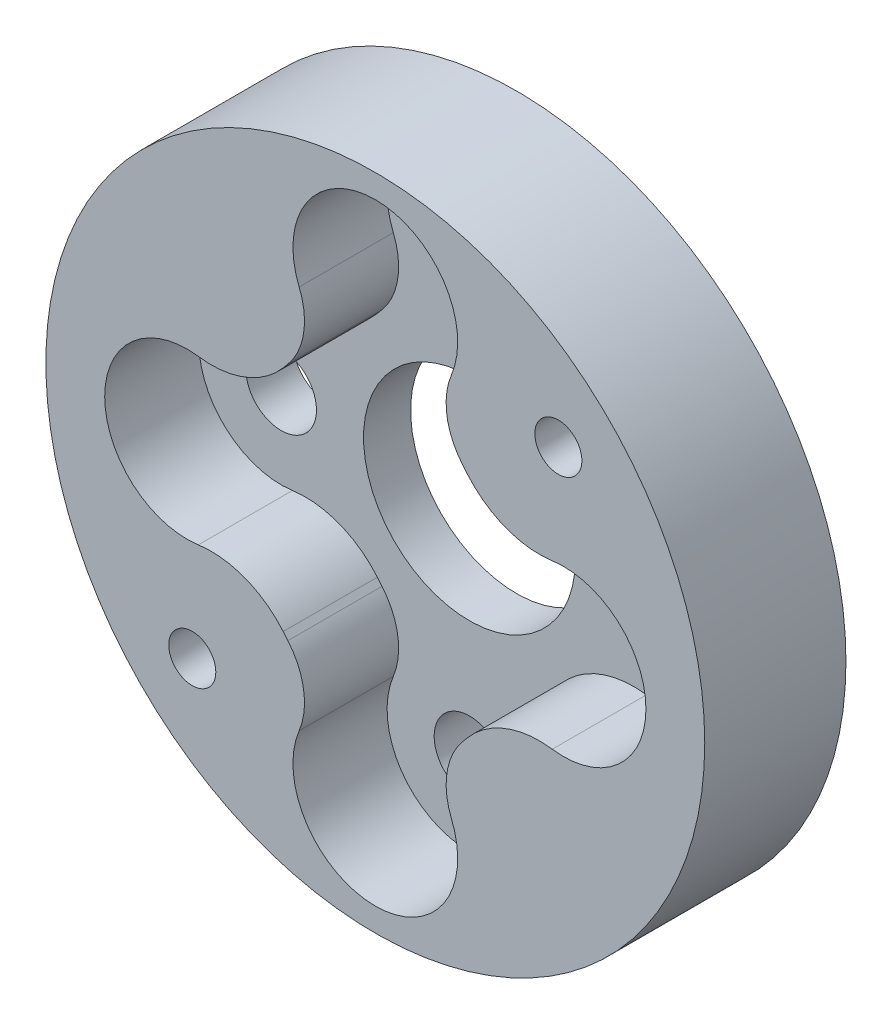
ISO-10303-21;
HEADER;
FILE_DESCRIPTION(('STEP AP214'),'2;1');
FILE_NAME('part.step','',(''),(''),'','','');
FILE_SCHEMA(('AUTOMOTIVE_DESIGN { 1 0 10303 214 1 1 1 1 }'));
ENDSEC;
DATA;
#1=APPLICATION_CONTEXT('core data for automotive mechanical design processes');
#2=APPLICATION_PROTOCOL_DEFINITION('international standard','automotive_design',2000,#1);
#3=PRODUCT_CONTEXT('',#1,'mechanical');
#4=PRODUCT('Part','Part','',(#3));
#5=PRODUCT_RELATED_PRODUCT_CATEGORY('part','',(#4));
#6=PRODUCT_DEFINITION_FORMATION('','',#4);
#7=PRODUCT_DEFINITION_CONTEXT('part definition',#1,'design');
#8=PRODUCT_DEFINITION('design','',#6,#7);
#9=PRODUCT_DEFINITION_SHAPE('','',#8);
#10=(LENGTH_UNIT() NAMED_UNIT(*) SI_UNIT(.MILLI.,.METRE.));
#11=(NAMED_UNIT(*) PLANE_ANGLE_UNIT() SI_UNIT($,.RADIAN.));
#12=(NAMED_UNIT(*) SI_UNIT($,.STERADIAN.) SOLID_ANGLE_UNIT());
#13=UNCERTAINTY_MEASURE_WITH_UNIT(LENGTH_MEASURE(1.E-05),#10,'distance_accuracy_value','');
#14=(GEOMETRIC_REPRESENTATION_CONTEXT(3) GLOBAL_UNCERTAINTY_ASSIGNED_CONTEXT((#13)) GLOBAL_UNIT_ASSIGNED_CONTEXT((#10,
#11,#12)) REPRESENTATION_CONTEXT('',''));
#15=CARTESIAN_POINT('',(0.,0.,0.));
#16=DIRECTION('',(0.,0.,1.));
#17=DIRECTION('',(1.,0.,0.));
#18=AXIS2_PLACEMENT_3D('',#15,#16,#17);
#19=CARTESIAN_POINT('',(0.,0.,2.));
#20=DIRECTION('',(0.,0.,-1.));
#21=DIRECTION('',(-1.,0.,0.));
#22=AXIS2_PLACEMENT_3D('',#19,#20,#21);
#23=CYLINDRICAL_SURFACE('',#22,14.);
#24=CARTESIAN_POINT('',(0.,0.,0.));
#25=DIRECTION('',(0.,0.,1.));
#26=DIRECTION('',(1.,0.,0.));
#27=AXIS2_PLACEMENT_3D('',#24,#25,#26);
#28=CIRCLE('',#27,14.);
#29=CARTESIAN_POINT('',(14.,0.,0.));
#30=VERTEX_POINT('',#29);
#31=EDGE_CURVE('E11',#30,#30,#28,.T.);
#32=ORIENTED_EDGE('',*,*,#31,.T.);
#33=EDGE_LOOP('',(#32));
#34=FACE_BOUND('',#33,.T.);
#35=CARTESIAN_POINT('',(0.,0.,6.));
#36=DIRECTION('',(0.,0.,1.));
#37=DIRECTION('',(1.,0.,0.));
#38=AXIS2_PLACEMENT_3D('',#35,#36,#37);
#39=CIRCLE('',#38,14.);
#40=CARTESIAN_POINT('',(14.,0.,6.));
#41=VERTEX_POINT('',#40);
#42=EDGE_CURVE('E273',#41,#41,#39,.T.);
#43=ORIENTED_EDGE('',*,*,#42,.F.);
#44=EDGE_LOOP('',(#43));
#45=FACE_BOUND('',#44,.T.);
#46=ADVANCED_FACE('F32',(#34,#45),#23,.T.);
#47=CARTESIAN_POINT('',(0.,0.,2.));
#48=DIRECTION('',(0.,0.,1.));
#49=DIRECTION('',(1.,0.,0.));
#50=AXIS2_PLACEMENT_3D('',#47,#48,#49);
#51=PLANE('',#50);
#52=CARTESIAN_POINT('',(-6.97306161399816,7.42936050756429,2.));
#53=DIRECTION('',(0.,0.,-1.));
#54=DIRECTION('',(-1.,0.,0.));
#55=AXIS2_PLACEMENT_3D('',#52,#53,#54);
#56=CIRCLE('',#55,4.);
#57=CARTESIAN_POINT('',(-3.91341682152996,4.85281752443317,2.));
#58=VERTEX_POINT('',#57);
#59=CARTESIAN_POINT('',(-7.52076208653247,3.46703490353,2.));
#60=VERTEX_POINT('',#59);
#61=EDGE_CURVE('E152',#58,#60,#56,.T.);
#62=ORIENTED_EDGE('',*,*,#61,.T.);
#63=CARTESIAN_POINT('',(-8.,0.,2.));
#64=DIRECTION('',(0.,0.,1.));
#65=DIRECTION('',(1.,0.,0.));
#66=AXIS2_PLACEMENT_3D('',#63,#64,#65);
#67=CIRCLE('',#66,3.5);
#68=CARTESIAN_POINT('',(-7.52076208653248,-3.46703490353,2.));
#69=VERTEX_POINT('',#68);
#70=EDGE_CURVE('E196',#60,#69,#67,.T.);
#71=ORIENTED_EDGE('',*,*,#70,.T.);
#72=CARTESIAN_POINT('',(-6.97306161399816,-7.42936050756429,2.));
#73=DIRECTION('',(0.,0.,-1.));
#74=DIRECTION('',(-1.,0.,0.));
#75=AXIS2_PLACEMENT_3D('',#72,#73,#74);
#76=CIRCLE('',#75,4.);
#77=CARTESIAN_POINT('',(-3.91341682152996,-4.85281752443317,2.));
#78=VERTEX_POINT('',#77);
#79=EDGE_CURVE('E158',#69,#78,#76,.T.);
#80=ORIENTED_EDGE('',*,*,#79,.T.);
#81=DIRECTION('',(0.644135745782779,-0.764911198117051,0.));
#82=VECTOR('',#81,1.);
#83=CARTESIAN_POINT('',(-3.91341682152996,-4.85281752443317,2.));
#84=LINE('',#83,#82);
#85=CARTESIAN_POINT('',(-3.71426790385243,-5.08930686417524,2.));
#86=VERTEX_POINT('',#85);
#87=EDGE_CURVE('E200',#78,#86,#84,.T.);
#88=ORIENTED_EDGE('',*,*,#87,.T.);
#89=CARTESIAN_POINT('',(-6.00900149820358,-7.02171410152358,2.));
#90=DIRECTION('',(0.,0.,-1.));
#91=DIRECTION('',(-1.,0.,0.));
#92=AXIS2_PLACEMENT_3D('',#89,#90,#91);
#93=CIRCLE('',#92,3.);
#94=CARTESIAN_POINT('',(-3.23561619134039,-8.16553836235885,2.));
#95=VERTEX_POINT('',#94);
#96=EDGE_CURVE('E203',#86,#95,#93,.T.);
#97=ORIENTED_EDGE('',*,*,#96,.T.);
#98=CARTESIAN_POINT('',(0.,-9.5,2.));
#99=DIRECTION('',(0.,0.,1.));
#100=DIRECTION('',(1.,0.,0.));
#101=AXIS2_PLACEMENT_3D('',#98,#99,#100);
#102=CIRCLE('',#101,3.5);
#103=CARTESIAN_POINT('',(3.23561619134039,-8.16553836235885,2.));
#104=VERTEX_POINT('',#103);
#105=EDGE_CURVE('E206',#95,#104,#102,.T.);
#106=ORIENTED_EDGE('',*,*,#105,.T.);
#107=CARTESIAN_POINT('',(6.00900149820358,-7.02171410152358,2.));
#108=DIRECTION('',(0.,0.,-1.));
#109=DIRECTION('',(-1.,0.,0.));
#110=AXIS2_PLACEMENT_3D('',#107,#108,#109);
#111=CIRCLE('',#110,3.);
#112=CARTESIAN_POINT('',(3.71426790385243,-5.08930686417524,2.));
#113=VERTEX_POINT('',#112);
#114=EDGE_CURVE('E209',#104,#113,#111,.T.);
#115=ORIENTED_EDGE('',*,*,#114,.T.);
#116=DIRECTION('',(0.644135745782779,0.764911198117051,0.));
#117=VECTOR('',#116,1.);
#118=CARTESIAN_POINT('',(3.71426790385243,-5.08930686417524,2.));
#119=LINE('',#118,#117);
#120=CARTESIAN_POINT('',(3.91341682152996,-4.85281752443317,2.));
#121=VERTEX_POINT('',#120);
#122=EDGE_CURVE('E212',#113,#121,#119,.T.);
#123=ORIENTED_EDGE('',*,*,#122,.T.);
#124=CARTESIAN_POINT('',(6.97306161399816,-7.42936050756429,2.));
#125=DIRECTION('',(0.,0.,-1.));
#126=DIRECTION('',(-1.,0.,0.));
#127=AXIS2_PLACEMENT_3D('',#124,#125,#126);
#128=CIRCLE('',#127,4.);
#129=CARTESIAN_POINT('',(7.52076208653248,-3.46703490353,2.));
#130=VERTEX_POINT('',#129);
#131=EDGE_CURVE('E215',#121,#130,#128,.T.);
#132=ORIENTED_EDGE('',*,*,#131,.T.);
#133=CARTESIAN_POINT('',(8.,0.,2.));
#134=DIRECTION('',(0.,0.,1.));
#135=DIRECTION('',(-1.,0.,0.));
#136=AXIS2_PLACEMENT_3D('',#133,#134,#135);
#137=CIRCLE('',#136,3.5);
#138=CARTESIAN_POINT('',(7.52076208653248,3.46703490353,2.));
#139=VERTEX_POINT('',#138);
#140=EDGE_CURVE('E218',#130,#139,#137,.T.);
#141=ORIENTED_EDGE('',*,*,#140,.T.);
#142=CARTESIAN_POINT('',(6.97306161399816,7.42936050756429,2.));
#143=DIRECTION('',(0.,0.,-1.));
#144=DIRECTION('',(1.,0.,0.));
#145=AXIS2_PLACEMENT_3D('',#142,#143,#144);
#146=CIRCLE('',#145,4.);
#147=CARTESIAN_POINT('',(3.91341682152996,4.85281752443317,2.));
#148=VERTEX_POINT('',#147);
#149=EDGE_CURVE('E221',#139,#148,#146,.T.);
#150=ORIENTED_EDGE('',*,*,#149,.T.);
#151=DIRECTION('',(-0.644135745782779,0.764911198117051,0.));
#152=VECTOR('',#151,1.);
#153=CARTESIAN_POINT('',(3.91341682152996,4.85281752443317,2.));
#154=LINE('',#153,#152);
#155=CARTESIAN_POINT('',(3.71426790385243,5.08930686417524,2.));
#156=VERTEX_POINT('',#155);
#157=EDGE_CURVE('E224',#148,#156,#154,.T.);
#158=ORIENTED_EDGE('',*,*,#157,.T.);
#159=CARTESIAN_POINT('',(6.00900149820358,7.02171410152358,2.));
#160=DIRECTION('',(0.,0.,-1.));
#161=DIRECTION('',(-1.,0.,0.));
#162=AXIS2_PLACEMENT_3D('',#159,#160,#161);
#163=CIRCLE('',#162,3.);
#164=CARTESIAN_POINT('',(3.23561619134039,8.16553836235885,2.));
#165=VERTEX_POINT('',#164);
#166=EDGE_CURVE('E227',#156,#165,#163,.T.);
#167=ORIENTED_EDGE('',*,*,#166,.T.);
#168=CARTESIAN_POINT('',(0.,9.5,2.));
#169=DIRECTION('',(0.,0.,1.));
#170=DIRECTION('',(-1.,0.,0.));
#171=AXIS2_PLACEMENT_3D('',#168,#169,#170);
#172=CIRCLE('',#171,3.5);
#173=CARTESIAN_POINT('',(-3.23561619134039,8.16553836235885,2.));
#174=VERTEX_POINT('',#173);
#175=EDGE_CURVE('E230',#165,#174,#172,.T.);
#176=ORIENTED_EDGE('',*,*,#175,.T.);
#177=CARTESIAN_POINT('',(-6.00900149820358,7.02171410152358,2.));
#178=DIRECTION('',(0.,0.,-1.));
#179=DIRECTION('',(-1.,0.,0.));
#180=AXIS2_PLACEMENT_3D('',#177,#178,#179);
#181=CIRCLE('',#180,3.);
#182=CARTESIAN_POINT('',(-3.71426790385243,5.08930686417524,2.));
#183=VERTEX_POINT('',#182);
#184=EDGE_CURVE('E233',#174,#183,#181,.T.);
#185=ORIENTED_EDGE('',*,*,#184,.T.);
#186=DIRECTION('',(-0.644135745782779,-0.764911198117051,0.));
#187=VECTOR('',#186,1.);
#188=CARTESIAN_POINT('',(-3.71426790385243,5.08930686417524,2.));
#189=LINE('',#188,#187);
#190=EDGE_CURVE('E236',#183,#58,#189,.T.);
#191=ORIENTED_EDGE('',*,*,#190,.T.);
#192=EDGE_LOOP('',(#62,#71,#80,#88,#97,#106,#115,#123,#132,#141,#150,#158,#167,#176,#185,#191));
#193=FACE_BOUND('',#192,.T.);
#194=CARTESIAN_POINT('',(-8.,0.,2.));
#195=DIRECTION('',(0.,0.,1.));
#196=DIRECTION('',(1.,0.,0.));
#197=AXIS2_PLACEMENT_3D('',#194,#195,#196);
#198=CIRCLE('',#197,1.5);
#199=CARTESIAN_POINT('',(-6.5,0.,2.));
#200=VERTEX_POINT('',#199);
#201=EDGE_CURVE('E279',#200,#200,#198,.T.);
#202=ORIENTED_EDGE('',*,*,#201,.F.);
#203=EDGE_LOOP('',(#202));
#204=FACE_BOUND('',#203,.T.);
#205=CARTESIAN_POINT('',(0.,0.,2.));
#206=DIRECTION('',(0.,0.,1.));
#207=DIRECTION('',(1.,0.,0.));
#208=AXIS2_PLACEMENT_3D('',#205,#206,#207);
#209=CIRCLE('',#208,4.5);
#210=CARTESIAN_POINT('',(4.5,0.,2.));
#211=VERTEX_POINT('',#210);
#212=EDGE_CURVE('E276',#211,#211,#209,.T.);
#213=ORIENTED_EDGE('',*,*,#212,.F.);
#214=EDGE_LOOP('',(#213));
#215=FACE_BOUND('',#214,.T.);
#216=CARTESIAN_POINT('',(0.,-9.5,2.));
#217=DIRECTION('',(0.,0.,1.));
#218=DIRECTION('',(-1.,0.,0.));
#219=AXIS2_PLACEMENT_3D('',#216,#217,#218);
#220=CIRCLE('',#219,1.5);
#221=CARTESIAN_POINT('',(-1.5,-9.5,2.));
#222=VERTEX_POINT('',#221);
#223=EDGE_CURVE('E287',#222,#222,#220,.T.);
#224=ORIENTED_EDGE('',*,*,#223,.F.);
#225=EDGE_LOOP('',(#224));
#226=FACE_BOUND('',#225,.T.);
#227=CARTESIAN_POINT('',(8.,0.,2.));
#228=DIRECTION('',(0.,0.,1.));
#229=DIRECTION('',(-1.,0.,0.));
#230=AXIS2_PLACEMENT_3D('',#227,#228,#229);
#231=CIRCLE('',#230,1.5);
#232=CARTESIAN_POINT('',(6.5,0.,2.));
#233=VERTEX_POINT('',#232);
#234=EDGE_CURVE('E286',#233,#233,#231,.T.);
#235=ORIENTED_EDGE('',*,*,#234,.F.);
#236=EDGE_LOOP('',(#235));
#237=FACE_BOUND('',#236,.T.);
#238=CARTESIAN_POINT('',(0.,9.5,2.));
#239=DIRECTION('',(0.,0.,1.));
#240=DIRECTION('',(1.,0.,0.));
#241=AXIS2_PLACEMENT_3D('',#238,#239,#240);
#242=CIRCLE('',#241,1.5);
#243=CARTESIAN_POINT('',(1.5,9.5,2.));
#244=VERTEX_POINT('',#243);
#245=EDGE_CURVE('E297',#244,#244,#242,.T.);
#246=ORIENTED_EDGE('',*,*,#245,.F.);
#247=EDGE_LOOP('',(#246));
#248=FACE_BOUND('',#247,.T.);
#249=ADVANCED_FACE('F307',(#193,#204,#215,#226,#237,#248),#51,.T.);
#250=CARTESIAN_POINT('',(0.,0.,0.));
#251=DIRECTION('',(0.,0.,1.));
#252=DIRECTION('',(1.,0.,0.));
#253=AXIS2_PLACEMENT_3D('',#250,#251,#252);
#254=PLANE('',#253);
#255=CARTESIAN_POINT('',(7.77817459305201,7.77817459305205,0.));
#256=DIRECTION('',(0.,0.,1.));
#257=DIRECTION('',(1.,0.,0.));
#258=AXIS2_PLACEMENT_3D('',#255,#256,#257);
#259=CIRCLE('',#258,1.00000000000001);
#260=CARTESIAN_POINT('',(8.77817459305201,7.77817459305205,0.));
#261=VERTEX_POINT('',#260);
#262=EDGE_CURVE('E198',#261,#261,#259,.T.);
#263=ORIENTED_EDGE('',*,*,#262,.T.);
#264=EDGE_LOOP('',(#263));
#265=FACE_BOUND('',#264,.T.);
#266=CARTESIAN_POINT('',(-7.77817459305201,-7.77817459305204,0.));
#267=DIRECTION('',(0.,0.,1.));
#268=DIRECTION('',(1.,0.,0.));
#269=AXIS2_PLACEMENT_3D('',#266,#267,#268);
#270=CIRCLE('',#269,1.);
#271=CARTESIAN_POINT('',(-6.77817459305201,-7.77817459305204,0.));
#272=VERTEX_POINT('',#271);
#273=EDGE_CURVE('E352',#272,#272,#270,.T.);
#274=ORIENTED_EDGE('',*,*,#273,.T.);
#275=EDGE_LOOP('',(#274));
#276=FACE_BOUND('',#275,.T.);
#277=CARTESIAN_POINT('',(-8.,0.,0.));
#278=DIRECTION('',(0.,0.,1.));
#279=DIRECTION('',(1.,0.,0.));
#280=AXIS2_PLACEMENT_3D('',#277,#278,#279);
#281=CIRCLE('',#280,1.5);
#282=CARTESIAN_POINT('',(-6.5,0.,0.));
#283=VERTEX_POINT('',#282);
#284=EDGE_CURVE('E39',#283,#283,#281,.T.);
#285=ORIENTED_EDGE('',*,*,#284,.T.);
#286=EDGE_LOOP('',(#285));
#287=FACE_BOUND('',#286,.T.);
#288=CARTESIAN_POINT('',(0.,0.,0.));
#289=DIRECTION('',(0.,0.,1.));
#290=DIRECTION('',(1.,0.,0.));
#291=AXIS2_PLACEMENT_3D('',#288,#289,#290);
#292=CIRCLE('',#291,4.5);
#293=CARTESIAN_POINT('',(4.5,0.,0.));
#294=VERTEX_POINT('',#293);
#295=EDGE_CURVE('E290',#294,#294,#292,.T.);
#296=ORIENTED_EDGE('',*,*,#295,.T.);
#297=EDGE_LOOP('',(#296));
#298=FACE_BOUND('',#297,.T.);
#299=CARTESIAN_POINT('',(0.,-9.5,0.));
#300=DIRECTION('',(0.,0.,1.));
#301=DIRECTION('',(-1.,0.,0.));
#302=AXIS2_PLACEMENT_3D('',#299,#300,#301);
#303=CIRCLE('',#302,1.5);
#304=CARTESIAN_POINT('',(-1.5,-9.5,0.));
#305=VERTEX_POINT('',#304);
#306=EDGE_CURVE('E283',#305,#305,#303,.T.);
#307=ORIENTED_EDGE('',*,*,#306,.T.);
#308=EDGE_LOOP('',(#307));
#309=FACE_BOUND('',#308,.T.);
#310=CARTESIAN_POINT('',(8.,0.,0.));
#311=DIRECTION('',(0.,0.,1.));
#312=DIRECTION('',(-1.,0.,0.));
#313=AXIS2_PLACEMENT_3D('',#310,#311,#312);
#314=CIRCLE('',#313,1.5);
#315=CARTESIAN_POINT('',(6.5,0.,0.));
#316=VERTEX_POINT('',#315);
#317=EDGE_CURVE('E300',#316,#316,#314,.T.);
#318=ORIENTED_EDGE('',*,*,#317,.T.);
#319=EDGE_LOOP('',(#318));
#320=FACE_BOUND('',#319,.T.);
#321=CARTESIAN_POINT('',(0.,9.5,0.));
#322=DIRECTION('',(0.,0.,1.));
#323=DIRECTION('',(1.,0.,0.));
#324=AXIS2_PLACEMENT_3D('',#321,#322,#323);
#325=CIRCLE('',#324,1.5);
#326=CARTESIAN_POINT('',(1.5,9.5,0.));
#327=VERTEX_POINT('',#326);
#328=EDGE_CURVE('E282',#327,#327,#325,.T.);
#329=ORIENTED_EDGE('',*,*,#328,.T.);
#330=EDGE_LOOP('',(#329));
#331=FACE_BOUND('',#330,.T.);
#332=ORIENTED_EDGE('',*,*,#31,.F.);
#333=EDGE_LOOP('',(#332));
#334=FACE_BOUND('',#333,.T.);
#335=ADVANCED_FACE('F310',(#265,#276,#287,#298,#309,#320,#331,#334),#254,.F.);
#336=CARTESIAN_POINT('',(0.,9.5,0.));
#337=DIRECTION('',(0.,0.,1.));
#338=DIRECTION('',(1.,0.,0.));
#339=AXIS2_PLACEMENT_3D('',#336,#337,#338);
#340=CYLINDRICAL_SURFACE('',#339,1.5);
#341=ORIENTED_EDGE('',*,*,#328,.F.);
#342=EDGE_LOOP('',(#341));
#343=FACE_BOUND('',#342,.T.);
#344=ORIENTED_EDGE('',*,*,#245,.T.);
#345=EDGE_LOOP('',(#344));
#346=FACE_BOUND('',#345,.T.);
#347=ADVANCED_FACE('F315',(#343,#346),#340,.F.);
#348=CARTESIAN_POINT('',(8.,0.,0.));
#349=DIRECTION('',(0.,0.,1.));
#350=DIRECTION('',(1.,0.,0.));
#351=AXIS2_PLACEMENT_3D('',#348,#349,#350);
#352=CYLINDRICAL_SURFACE('',#351,1.5);
#353=ORIENTED_EDGE('',*,*,#317,.F.);
#354=EDGE_LOOP('',(#353));
#355=FACE_BOUND('',#354,.T.);
#356=ORIENTED_EDGE('',*,*,#234,.T.);
#357=EDGE_LOOP('',(#356));
#358=FACE_BOUND('',#357,.T.);
#359=ADVANCED_FACE('F305',(#355,#358),#352,.F.);
#360=CARTESIAN_POINT('',(0.,-9.5,0.));
#361=DIRECTION('',(0.,0.,1.));
#362=DIRECTION('',(1.,0.,0.));
#363=AXIS2_PLACEMENT_3D('',#360,#361,#362);
#364=CYLINDRICAL_SURFACE('',#363,1.5);
#365=ORIENTED_EDGE('',*,*,#306,.F.);
#366=EDGE_LOOP('',(#365));
#367=FACE_BOUND('',#366,.T.);
#368=ORIENTED_EDGE('',*,*,#223,.T.);
#369=EDGE_LOOP('',(#368));
#370=FACE_BOUND('',#369,.T.);
#371=ADVANCED_FACE('F323',(#367,#370),#364,.F.);
#372=CARTESIAN_POINT('',(0.,0.,0.));
#373=DIRECTION('',(0.,0.,1.));
#374=DIRECTION('',(1.,0.,0.));
#375=AXIS2_PLACEMENT_3D('',#372,#373,#374);
#376=CYLINDRICAL_SURFACE('',#375,4.5);
#377=ORIENTED_EDGE('',*,*,#295,.F.);
#378=EDGE_LOOP('',(#377));
#379=FACE_BOUND('',#378,.T.);
#380=ORIENTED_EDGE('',*,*,#212,.T.);
#381=EDGE_LOOP('',(#380));
#382=FACE_BOUND('',#381,.T.);
#383=ADVANCED_FACE('F368',(#379,#382),#376,.F.);
#384=CARTESIAN_POINT('',(-8.,0.,0.));
#385=DIRECTION('',(0.,0.,1.));
#386=DIRECTION('',(1.,0.,0.));
#387=AXIS2_PLACEMENT_3D('',#384,#385,#386);
#388=CYLINDRICAL_SURFACE('',#387,1.5);
#389=ORIENTED_EDGE('',*,*,#284,.F.);
#390=EDGE_LOOP('',(#389));
#391=FACE_BOUND('',#390,.T.);
#392=ORIENTED_EDGE('',*,*,#201,.T.);
#393=EDGE_LOOP('',(#392));
#394=FACE_BOUND('',#393,.T.);
#395=ADVANCED_FACE('F341',(#391,#394),#388,.F.);
#396=CARTESIAN_POINT('',(0.,0.,6.));
#397=DIRECTION('',(0.,0.,1.));
#398=DIRECTION('',(1.,0.,0.));
#399=AXIS2_PLACEMENT_3D('',#396,#397,#398);
#400=PLANE('',#399);
#401=CARTESIAN_POINT('',(-7.77817459305201,-7.77817459305204,6.));
#402=DIRECTION('',(0.,0.,1.));
#403=DIRECTION('',(1.,0.,0.));
#404=AXIS2_PLACEMENT_3D('',#401,#402,#403);
#405=CIRCLE('',#404,1.);
#406=CARTESIAN_POINT('',(-6.77817459305201,-7.77817459305204,6.));
#407=VERTEX_POINT('',#406);
#408=EDGE_CURVE('E270',#407,#407,#405,.T.);
#409=ORIENTED_EDGE('',*,*,#408,.F.);
#410=EDGE_LOOP('',(#409));
#411=FACE_BOUND('',#410,.T.);
#412=ORIENTED_EDGE('',*,*,#42,.T.);
#413=EDGE_LOOP('',(#412));
#414=FACE_BOUND('',#413,.T.);
#415=CARTESIAN_POINT('',(7.77817459305201,7.77817459305205,6.));
#416=DIRECTION('',(0.,0.,1.));
#417=DIRECTION('',(-1.,0.,0.));
#418=AXIS2_PLACEMENT_3D('',#415,#416,#417);
#419=CIRCLE('',#418,1.00000000000001);
#420=CARTESIAN_POINT('',(6.778174593052,7.77817459305205,6.));
#421=VERTEX_POINT('',#420);
#422=EDGE_CURVE('E159',#421,#421,#419,.T.);
#423=ORIENTED_EDGE('',*,*,#422,.F.);
#424=EDGE_LOOP('',(#423));
#425=FACE_BOUND('',#424,.T.);
#426=CARTESIAN_POINT('',(-6.97306161399816,-7.42936050756429,6.));
#427=DIRECTION('',(0.,0.,-1.));
#428=DIRECTION('',(-1.,0.,0.));
#429=AXIS2_PLACEMENT_3D('',#426,#427,#428);
#430=CIRCLE('',#429,4.);
#431=CARTESIAN_POINT('',(-7.52076208653248,-3.46703490353,6.));
#432=VERTEX_POINT('',#431);
#433=CARTESIAN_POINT('',(-3.91341682152996,-4.85281752443317,6.));
#434=VERTEX_POINT('',#433);
#435=EDGE_CURVE('E151',#432,#434,#430,.T.);
#436=ORIENTED_EDGE('',*,*,#435,.F.);
#437=CARTESIAN_POINT('',(-8.,0.,6.));
#438=DIRECTION('',(0.,0.,1.));
#439=DIRECTION('',(1.,0.,0.));
#440=AXIS2_PLACEMENT_3D('',#437,#438,#439);
#441=CIRCLE('',#440,3.5);
#442=CARTESIAN_POINT('',(-7.52076208653247,3.46703490353,6.));
#443=VERTEX_POINT('',#442);
#444=EDGE_CURVE('E143',#443,#432,#441,.T.);
#445=ORIENTED_EDGE('',*,*,#444,.F.);
#446=CARTESIAN_POINT('',(-6.97306161399816,7.42936050756429,6.));
#447=DIRECTION('',(0.,0.,-1.));
#448=DIRECTION('',(-1.,0.,0.));
#449=AXIS2_PLACEMENT_3D('',#446,#447,#448);
#450=CIRCLE('',#449,4.);
#451=CARTESIAN_POINT('',(-3.91341682152996,4.85281752443317,6.));
#452=VERTEX_POINT('',#451);
#453=EDGE_CURVE('E194',#452,#443,#450,.T.);
#454=ORIENTED_EDGE('',*,*,#453,.F.);
#455=DIRECTION('',(-0.644135745782779,-0.764911198117051,0.));
#456=VECTOR('',#455,1.);
#457=CARTESIAN_POINT('',(-3.71426790385243,5.08930686417524,6.));
#458=LINE('',#457,#456);
#459=CARTESIAN_POINT('',(-3.71426790385243,5.08930686417524,6.));
#460=VERTEX_POINT('',#459);
#461=EDGE_CURVE('E192',#460,#452,#458,.T.);
#462=ORIENTED_EDGE('',*,*,#461,.F.);
#463=CARTESIAN_POINT('',(-6.00900149820358,7.02171410152358,6.));
#464=DIRECTION('',(0.,0.,-1.));
#465=DIRECTION('',(-1.,0.,0.));
#466=AXIS2_PLACEMENT_3D('',#463,#464,#465);
#467=CIRCLE('',#466,3.);
#468=CARTESIAN_POINT('',(-3.23561619134039,8.16553836235885,6.));
#469=VERTEX_POINT('',#468);
#470=EDGE_CURVE('E190',#469,#460,#467,.T.);
#471=ORIENTED_EDGE('',*,*,#470,.F.);
#472=CARTESIAN_POINT('',(0.,9.5,6.));
#473=DIRECTION('',(0.,0.,1.));
#474=DIRECTION('',(-1.,0.,0.));
#475=AXIS2_PLACEMENT_3D('',#472,#473,#474);
#476=CIRCLE('',#475,3.5);
#477=CARTESIAN_POINT('',(3.23561619134039,8.16553836235885,6.));
#478=VERTEX_POINT('',#477);
#479=EDGE_CURVE('E188',#478,#469,#476,.T.);
#480=ORIENTED_EDGE('',*,*,#479,.F.);
#481=CARTESIAN_POINT('',(6.00900149820358,7.02171410152358,6.));
#482=DIRECTION('',(0.,0.,-1.));
#483=DIRECTION('',(-1.,0.,0.));
#484=AXIS2_PLACEMENT_3D('',#481,#482,#483);
#485=CIRCLE('',#484,3.);
#486=CARTESIAN_POINT('',(3.71426790385243,5.08930686417524,6.));
#487=VERTEX_POINT('',#486);
#488=EDGE_CURVE('E186',#487,#478,#485,.T.);
#489=ORIENTED_EDGE('',*,*,#488,.F.);
#490=DIRECTION('',(-0.644135745782779,0.764911198117051,0.));
#491=VECTOR('',#490,1.);
#492=CARTESIAN_POINT('',(3.91341682152996,4.85281752443317,6.));
#493=LINE('',#492,#491);
#494=CARTESIAN_POINT('',(3.91341682152996,4.85281752443317,6.));
#495=VERTEX_POINT('',#494);
#496=EDGE_CURVE('E184',#495,#487,#493,.T.);
#497=ORIENTED_EDGE('',*,*,#496,.F.);
#498=CARTESIAN_POINT('',(6.97306161399816,7.42936050756429,6.));
#499=DIRECTION('',(0.,0.,-1.));
#500=DIRECTION('',(1.,0.,0.));
#501=AXIS2_PLACEMENT_3D('',#498,#499,#500);
#502=CIRCLE('',#501,4.);
#503=CARTESIAN_POINT('',(7.52076208653248,3.46703490353,6.));
#504=VERTEX_POINT('',#503);
#505=EDGE_CURVE('E182',#504,#495,#502,.T.);
#506=ORIENTED_EDGE('',*,*,#505,.F.);
#507=CARTESIAN_POINT('',(8.,0.,6.));
#508=DIRECTION('',(0.,0.,1.));
#509=DIRECTION('',(-1.,0.,0.));
#510=AXIS2_PLACEMENT_3D('',#507,#508,#509);
#511=CIRCLE('',#510,3.5);
#512=CARTESIAN_POINT('',(7.52076208653248,-3.46703490353,6.));
#513=VERTEX_POINT('',#512);
#514=EDGE_CURVE('E180',#513,#504,#511,.T.);
#515=ORIENTED_EDGE('',*,*,#514,.F.);
#516=CARTESIAN_POINT('',(6.97306161399816,-7.42936050756429,6.));
#517=DIRECTION('',(0.,0.,-1.));
#518=DIRECTION('',(-1.,0.,0.));
#519=AXIS2_PLACEMENT_3D('',#516,#517,#518);
#520=CIRCLE('',#519,4.);
#521=CARTESIAN_POINT('',(3.91341682152996,-4.85281752443317,6.));
#522=VERTEX_POINT('',#521);
#523=EDGE_CURVE('E178',#522,#513,#520,.T.);
#524=ORIENTED_EDGE('',*,*,#523,.F.);
#525=DIRECTION('',(0.644135745782779,0.764911198117051,0.));
#526=VECTOR('',#525,1.);
#527=CARTESIAN_POINT('',(3.71426790385243,-5.08930686417524,6.));
#528=LINE('',#527,#526);
#529=CARTESIAN_POINT('',(3.71426790385243,-5.08930686417524,6.));
#530=VERTEX_POINT('',#529);
#531=EDGE_CURVE('E176',#530,#522,#528,.T.);
#532=ORIENTED_EDGE('',*,*,#531,.F.);
#533=CARTESIAN_POINT('',(6.00900149820358,-7.02171410152358,6.));
#534=DIRECTION('',(0.,0.,-1.));
#535=DIRECTION('',(-1.,0.,0.));
#536=AXIS2_PLACEMENT_3D('',#533,#534,#535);
#537=CIRCLE('',#536,3.);
#538=CARTESIAN_POINT('',(3.23561619134039,-8.16553836235885,6.));
#539=VERTEX_POINT('',#538);
#540=EDGE_CURVE('E174',#539,#530,#537,.T.);
#541=ORIENTED_EDGE('',*,*,#540,.F.);
#542=CARTESIAN_POINT('',(0.,-9.5,6.));
#543=DIRECTION('',(0.,0.,1.));
#544=DIRECTION('',(1.,0.,0.));
#545=AXIS2_PLACEMENT_3D('',#542,#543,#544);
#546=CIRCLE('',#545,3.5);
#547=CARTESIAN_POINT('',(-3.23561619134039,-8.16553836235885,6.));
#548=VERTEX_POINT('',#547);
#549=EDGE_CURVE('E172',#548,#539,#546,.T.);
#550=ORIENTED_EDGE('',*,*,#549,.F.);
#551=CARTESIAN_POINT('',(-6.00900149820358,-7.02171410152358,6.));
#552=DIRECTION('',(0.,0.,-1.));
#553=DIRECTION('',(-1.,0.,0.));
#554=AXIS2_PLACEMENT_3D('',#551,#552,#553);
#555=CIRCLE('',#554,3.);
#556=CARTESIAN_POINT('',(-3.71426790385243,-5.08930686417524,6.));
#557=VERTEX_POINT('',#556);
#558=EDGE_CURVE('E167',#557,#548,#555,.T.);
#559=ORIENTED_EDGE('',*,*,#558,.F.);
#560=DIRECTION('',(0.644135745782779,-0.764911198117051,0.));
#561=VECTOR('',#560,1.);
#562=CARTESIAN_POINT('',(-3.91341682152996,-4.85281752443317,6.));
#563=LINE('',#562,#561);
#564=EDGE_CURVE('E165',#434,#557,#563,.T.);
#565=ORIENTED_EDGE('',*,*,#564,.F.);
#566=EDGE_LOOP('',(#436,#445,#454,#462,#471,#480,#489,#497,#506,#515,#524,#532,#541,#550,#559,#565));
#567=FACE_BOUND('',#566,.T.);
#568=ADVANCED_FACE('F163',(#411,#414,#425,#567),#400,.T.);
#569=CARTESIAN_POINT('',(-7.77817459305201,-7.77817459305204,6.));
#570=DIRECTION('',(0.,0.,-1.));
#571=DIRECTION('',(-1.,0.,0.));
#572=AXIS2_PLACEMENT_3D('',#569,#570,#571);
#573=CYLINDRICAL_SURFACE('',#572,1.);
#574=ORIENTED_EDGE('',*,*,#408,.T.);
#575=EDGE_LOOP('',(#574));
#576=FACE_BOUND('',#575,.T.);
#577=ORIENTED_EDGE('',*,*,#273,.F.);
#578=EDGE_LOOP('',(#577));
#579=FACE_BOUND('',#578,.T.);
#580=ADVANCED_FACE('F340',(#576,#579),#573,.F.);
#581=CARTESIAN_POINT('',(7.77817459305201,7.77817459305205,6.));
#582=DIRECTION('',(0.,0.,-1.));
#583=DIRECTION('',(-1.,0.,0.));
#584=AXIS2_PLACEMENT_3D('',#581,#582,#583);
#585=CYLINDRICAL_SURFACE('',#584,1.00000000000001);
#586=ORIENTED_EDGE('',*,*,#422,.T.);
#587=EDGE_LOOP('',(#586));
#588=FACE_BOUND('',#587,.T.);
#589=ORIENTED_EDGE('',*,*,#262,.F.);
#590=EDGE_LOOP('',(#589));
#591=FACE_BOUND('',#590,.T.);
#592=ADVANCED_FACE('F346',(#588,#591),#585,.F.);
#593=CARTESIAN_POINT('',(-8.,0.,6.));
#594=DIRECTION('',(0.,0.,-1.));
#595=DIRECTION('',(-1.,0.,0.));
#596=AXIS2_PLACEMENT_3D('',#593,#594,#595);
#597=CYLINDRICAL_SURFACE('',#596,3.5);
#598=ORIENTED_EDGE('',*,*,#70,.F.);
#599=DIRECTION('',(0.,0.,-1.));
#600=VECTOR('',#599,1.);
#601=CARTESIAN_POINT('',(-7.52076208653247,3.46703490353,6.));
#602=LINE('',#601,#600);
#603=EDGE_CURVE('E46',#443,#60,#602,.T.);
#604=ORIENTED_EDGE('',*,*,#603,.F.);
#605=ORIENTED_EDGE('',*,*,#444,.T.);
#606=DIRECTION('',(0.,0.,-1.));
#607=VECTOR('',#606,1.);
#608=CARTESIAN_POINT('',(-7.52076208653248,-3.46703490353,6.));
#609=LINE('',#608,#607);
#610=EDGE_CURVE('E146',#432,#69,#609,.T.);
#611=ORIENTED_EDGE('',*,*,#610,.T.);
#612=EDGE_LOOP('',(#598,#604,#605,#611));
#613=FACE_BOUND('',#612,.T.);
#614=ADVANCED_FACE('F145',(#613),#597,.F.);
#615=CARTESIAN_POINT('',(-6.97306161399816,-7.42936050756429,6.));
#616=DIRECTION('',(0.,0.,-1.));
#617=DIRECTION('',(-1.,0.,0.));
#618=AXIS2_PLACEMENT_3D('',#615,#616,#617);
#619=CYLINDRICAL_SURFACE('',#618,4.);
#620=ORIENTED_EDGE('',*,*,#79,.F.);
#621=ORIENTED_EDGE('',*,*,#610,.F.);
#622=ORIENTED_EDGE('',*,*,#435,.T.);
#623=DIRECTION('',(0.,0.,-1.));
#624=VECTOR('',#623,1.);
#625=CARTESIAN_POINT('',(-3.91341682152996,-4.85281752443317,6.));
#626=LINE('',#625,#624);
#627=EDGE_CURVE('E160',#434,#78,#626,.T.);
#628=ORIENTED_EDGE('',*,*,#627,.T.);
#629=EDGE_LOOP('',(#620,#621,#622,#628));
#630=FACE_BOUND('',#629,.T.);
#631=ADVANCED_FACE('F155',(#630),#619,.T.);
#632=CARTESIAN_POINT('',(-3.91341682152996,-4.85281752443317,6.));
#633=DIRECTION('',(0.764911198117051,0.644135745782779,0.));
#634=DIRECTION('',(-0.644135745782779,0.764911198117051,0.));
#635=AXIS2_PLACEMENT_3D('',#632,#633,#634);
#636=PLANE('',#635);
#637=ORIENTED_EDGE('',*,*,#87,.F.);
#638=ORIENTED_EDGE('',*,*,#627,.F.);
#639=ORIENTED_EDGE('',*,*,#564,.T.);
#640=DIRECTION('',(0.,0.,-1.));
#641=VECTOR('',#640,1.);
#642=CARTESIAN_POINT('',(-3.71426790385243,-5.08930686417524,6.));
#643=LINE('',#642,#641);
#644=EDGE_CURVE('E265',#557,#86,#643,.T.);
#645=ORIENTED_EDGE('',*,*,#644,.T.);
#646=EDGE_LOOP('',(#637,#638,#639,#645));
#647=FACE_BOUND('',#646,.T.);
#648=ADVANCED_FACE('F421',(#647),#636,.T.);
#649=CARTESIAN_POINT('',(-6.00900149820358,-7.02171410152358,6.));
#650=DIRECTION('',(0.,0.,-1.));
#651=DIRECTION('',(-1.,0.,0.));
#652=AXIS2_PLACEMENT_3D('',#649,#650,#651);
#653=CYLINDRICAL_SURFACE('',#652,3.);
#654=ORIENTED_EDGE('',*,*,#96,.F.);
#655=ORIENTED_EDGE('',*,*,#644,.F.);
#656=ORIENTED_EDGE('',*,*,#558,.T.);
#657=DIRECTION('',(0.,0.,-1.));
#658=VECTOR('',#657,1.);
#659=CARTESIAN_POINT('',(-3.23561619134039,-8.16553836235885,6.));
#660=LINE('',#659,#658);
#661=EDGE_CURVE('E263',#548,#95,#660,.T.);
#662=ORIENTED_EDGE('',*,*,#661,.T.);
#663=EDGE_LOOP('',(#654,#655,#656,#662));
#664=FACE_BOUND('',#663,.T.);
#665=ADVANCED_FACE('F430',(#664),#653,.T.);
#666=CARTESIAN_POINT('',(0.,-9.5,6.));
#667=DIRECTION('',(0.,0.,-1.));
#668=DIRECTION('',(-1.,0.,0.));
#669=AXIS2_PLACEMENT_3D('',#666,#667,#668);
#670=CYLINDRICAL_SURFACE('',#669,3.5);
#671=ORIENTED_EDGE('',*,*,#105,.F.);
#672=ORIENTED_EDGE('',*,*,#661,.F.);
#673=ORIENTED_EDGE('',*,*,#549,.T.);
#674=DIRECTION('',(0.,0.,-1.));
#675=VECTOR('',#674,1.);
#676=CARTESIAN_POINT('',(3.23561619134039,-8.16553836235885,6.));
#677=LINE('',#676,#675);
#678=EDGE_CURVE('E261',#539,#104,#677,.T.);
#679=ORIENTED_EDGE('',*,*,#678,.T.);
#680=EDGE_LOOP('',(#671,#672,#673,#679));
#681=FACE_BOUND('',#680,.T.);
#682=ADVANCED_FACE('F440',(#681),#670,.F.);
#683=CARTESIAN_POINT('',(6.00900149820358,-7.02171410152358,6.));
#684=DIRECTION('',(0.,0.,-1.));
#685=DIRECTION('',(-1.,0.,0.));
#686=AXIS2_PLACEMENT_3D('',#683,#684,#685);
#687=CYLINDRICAL_SURFACE('',#686,3.);
#688=ORIENTED_EDGE('',*,*,#114,.F.);
#689=ORIENTED_EDGE('',*,*,#678,.F.);
#690=ORIENTED_EDGE('',*,*,#540,.T.);
#691=DIRECTION('',(0.,0.,-1.));
#692=VECTOR('',#691,1.);
#693=CARTESIAN_POINT('',(3.71426790385243,-5.08930686417524,6.));
#694=LINE('',#693,#692);
#695=EDGE_CURVE('E259',#530,#113,#694,.T.);
#696=ORIENTED_EDGE('',*,*,#695,.T.);
#697=EDGE_LOOP('',(#688,#689,#690,#696));
#698=FACE_BOUND('',#697,.T.);
#699=ADVANCED_FACE('F450',(#698),#687,.T.);
#700=CARTESIAN_POINT('',(3.71426790385243,-5.08930686417524,6.));
#701=DIRECTION('',(-0.764911198117051,0.644135745782779,0.));
#702=DIRECTION('',(-0.644135745782779,-0.764911198117051,0.));
#703=AXIS2_PLACEMENT_3D('',#700,#701,#702);
#704=PLANE('',#703);
#705=ORIENTED_EDGE('',*,*,#122,.F.);
#706=ORIENTED_EDGE('',*,*,#695,.F.);
#707=ORIENTED_EDGE('',*,*,#531,.T.);
#708=DIRECTION('',(0.,0.,-1.));
#709=VECTOR('',#708,1.);
#710=CARTESIAN_POINT('',(3.91341682152996,-4.85281752443317,6.));
#711=LINE('',#710,#709);
#712=EDGE_CURVE('E257',#522,#121,#711,.T.);
#713=ORIENTED_EDGE('',*,*,#712,.T.);
#714=EDGE_LOOP('',(#705,#706,#707,#713));
#715=FACE_BOUND('',#714,.T.);
#716=ADVANCED_FACE('F460',(#715),#704,.T.);
#717=CARTESIAN_POINT('',(6.97306161399816,-7.42936050756429,6.));
#718=DIRECTION('',(0.,0.,-1.));
#719=DIRECTION('',(-1.,0.,0.));
#720=AXIS2_PLACEMENT_3D('',#717,#718,#719);
#721=CYLINDRICAL_SURFACE('',#720,4.);
#722=ORIENTED_EDGE('',*,*,#131,.F.);
#723=ORIENTED_EDGE('',*,*,#712,.F.);
#724=ORIENTED_EDGE('',*,*,#523,.T.);
#725=DIRECTION('',(0.,0.,-1.));
#726=VECTOR('',#725,1.);
#727=CARTESIAN_POINT('',(7.52076208653248,-3.46703490353,6.));
#728=LINE('',#727,#726);
#729=EDGE_CURVE('E255',#513,#130,#728,.T.);
#730=ORIENTED_EDGE('',*,*,#729,.T.);
#731=EDGE_LOOP('',(#722,#723,#724,#730));
#732=FACE_BOUND('',#731,.T.);
#733=ADVANCED_FACE('F470',(#732),#721,.T.);
#734=CARTESIAN_POINT('',(8.,0.,6.));
#735=DIRECTION('',(0.,0.,-1.));
#736=DIRECTION('',(-1.,0.,0.));
#737=AXIS2_PLACEMENT_3D('',#734,#735,#736);
#738=CYLINDRICAL_SURFACE('',#737,3.5);
#739=ORIENTED_EDGE('',*,*,#140,.F.);
#740=ORIENTED_EDGE('',*,*,#729,.F.);
#741=ORIENTED_EDGE('',*,*,#514,.T.);
#742=DIRECTION('',(0.,0.,-1.));
#743=VECTOR('',#742,1.);
#744=CARTESIAN_POINT('',(7.52076208653248,3.46703490353,6.));
#745=LINE('',#744,#743);
#746=EDGE_CURVE('E253',#504,#139,#745,.T.);
#747=ORIENTED_EDGE('',*,*,#746,.T.);
#748=EDGE_LOOP('',(#739,#740,#741,#747));
#749=FACE_BOUND('',#748,.T.);
#750=ADVANCED_FACE('F480',(#749),#738,.F.);
#751=CARTESIAN_POINT('',(6.97306161399816,7.42936050756429,6.));
#752=DIRECTION('',(0.,0.,-1.));
#753=DIRECTION('',(-1.,0.,0.));
#754=AXIS2_PLACEMENT_3D('',#751,#752,#753);
#755=CYLINDRICAL_SURFACE('',#754,4.);
#756=ORIENTED_EDGE('',*,*,#149,.F.);
#757=ORIENTED_EDGE('',*,*,#746,.F.);
#758=ORIENTED_EDGE('',*,*,#505,.T.);
#759=DIRECTION('',(0.,0.,-1.));
#760=VECTOR('',#759,1.);
#761=CARTESIAN_POINT('',(3.91341682152996,4.85281752443317,6.));
#762=LINE('',#761,#760);
#763=EDGE_CURVE('E251',#495,#148,#762,.T.);
#764=ORIENTED_EDGE('',*,*,#763,.T.);
#765=EDGE_LOOP('',(#756,#757,#758,#764));
#766=FACE_BOUND('',#765,.T.);
#767=ADVANCED_FACE('F490',(#766),#755,.T.);
#768=CARTESIAN_POINT('',(3.91341682152996,4.85281752443317,6.));
#769=DIRECTION('',(-0.764911198117051,-0.644135745782779,0.));
#770=DIRECTION('',(0.644135745782779,-0.764911198117051,0.));
#771=AXIS2_PLACEMENT_3D('',#768,#769,#770);
#772=PLANE('',#771);
#773=ORIENTED_EDGE('',*,*,#157,.F.);
#774=ORIENTED_EDGE('',*,*,#763,.F.);
#775=ORIENTED_EDGE('',*,*,#496,.T.);
#776=DIRECTION('',(0.,0.,-1.));
#777=VECTOR('',#776,1.);
#778=CARTESIAN_POINT('',(3.71426790385243,5.08930686417524,6.));
#779=LINE('',#778,#777);
#780=EDGE_CURVE('E249',#487,#156,#779,.T.);
#781=ORIENTED_EDGE('',*,*,#780,.T.);
#782=EDGE_LOOP('',(#773,#774,#775,#781));
#783=FACE_BOUND('',#782,.T.);
#784=ADVANCED_FACE('F500',(#783),#772,.T.);
#785=CARTESIAN_POINT('',(6.00900149820358,7.02171410152358,6.));
#786=DIRECTION('',(0.,0.,-1.));
#787=DIRECTION('',(-1.,0.,0.));
#788=AXIS2_PLACEMENT_3D('',#785,#786,#787);
#789=CYLINDRICAL_SURFACE('',#788,3.);
#790=ORIENTED_EDGE('',*,*,#166,.F.);
#791=ORIENTED_EDGE('',*,*,#780,.F.);
#792=ORIENTED_EDGE('',*,*,#488,.T.);
#793=DIRECTION('',(0.,0.,-1.));
#794=VECTOR('',#793,1.);
#795=CARTESIAN_POINT('',(3.23561619134039,8.16553836235885,6.));
#796=LINE('',#795,#794);
#797=EDGE_CURVE('E247',#478,#165,#796,.T.);
#798=ORIENTED_EDGE('',*,*,#797,.T.);
#799=EDGE_LOOP('',(#790,#791,#792,#798));
#800=FACE_BOUND('',#799,.T.);
#801=ADVANCED_FACE('F510',(#800),#789,.T.);
#802=CARTESIAN_POINT('',(0.,9.5,6.));
#803=DIRECTION('',(0.,0.,-1.));
#804=DIRECTION('',(-1.,0.,0.));
#805=AXIS2_PLACEMENT_3D('',#802,#803,#804);
#806=CYLINDRICAL_SURFACE('',#805,3.5);
#807=ORIENTED_EDGE('',*,*,#175,.F.);
#808=ORIENTED_EDGE('',*,*,#797,.F.);
#809=ORIENTED_EDGE('',*,*,#479,.T.);
#810=DIRECTION('',(0.,0.,-1.));
#811=VECTOR('',#810,1.);
#812=CARTESIAN_POINT('',(-3.23561619134039,8.16553836235885,6.));
#813=LINE('',#812,#811);
#814=EDGE_CURVE('E245',#469,#174,#813,.T.);
#815=ORIENTED_EDGE('',*,*,#814,.T.);
#816=EDGE_LOOP('',(#807,#808,#809,#815));
#817=FACE_BOUND('',#816,.T.);
#818=ADVANCED_FACE('F520',(#817),#806,.F.);
#819=CARTESIAN_POINT('',(-6.00900149820358,7.02171410152358,6.));
#820=DIRECTION('',(0.,0.,-1.));
#821=DIRECTION('',(-1.,0.,0.));
#822=AXIS2_PLACEMENT_3D('',#819,#820,#821);
#823=CYLINDRICAL_SURFACE('',#822,3.);
#824=ORIENTED_EDGE('',*,*,#184,.F.);
#825=ORIENTED_EDGE('',*,*,#814,.F.);
#826=ORIENTED_EDGE('',*,*,#470,.T.);
#827=DIRECTION('',(0.,0.,-1.));
#828=VECTOR('',#827,1.);
#829=CARTESIAN_POINT('',(-3.71426790385243,5.08930686417524,6.));
#830=LINE('',#829,#828);
#831=EDGE_CURVE('E243',#460,#183,#830,.T.);
#832=ORIENTED_EDGE('',*,*,#831,.T.);
#833=EDGE_LOOP('',(#824,#825,#826,#832));
#834=FACE_BOUND('',#833,.T.);
#835=ADVANCED_FACE('F530',(#834),#823,.T.);
#836=CARTESIAN_POINT('',(-3.71426790385243,5.08930686417524,6.));
#837=DIRECTION('',(0.764911198117051,-0.644135745782779,0.));
#838=DIRECTION('',(0.644135745782779,0.764911198117051,0.));
#839=AXIS2_PLACEMENT_3D('',#836,#837,#838);
#840=PLANE('',#839);
#841=ORIENTED_EDGE('',*,*,#190,.F.);
#842=ORIENTED_EDGE('',*,*,#831,.F.);
#843=ORIENTED_EDGE('',*,*,#461,.T.);
#844=DIRECTION('',(0.,0.,-1.));
#845=VECTOR('',#844,1.);
#846=CARTESIAN_POINT('',(-3.91341682152996,4.85281752443317,6.));
#847=LINE('',#846,#845);
#848=EDGE_CURVE('E51',#452,#58,#847,.T.);
#849=ORIENTED_EDGE('',*,*,#848,.T.);
#850=EDGE_LOOP('',(#841,#842,#843,#849));
#851=FACE_BOUND('',#850,.T.);
#852=ADVANCED_FACE('F540',(#851),#840,.T.);
#853=CARTESIAN_POINT('',(-6.97306161399816,7.42936050756429,6.));
#854=DIRECTION('',(0.,0.,-1.));
#855=DIRECTION('',(-1.,0.,0.));
#856=AXIS2_PLACEMENT_3D('',#853,#854,#855);
#857=CYLINDRICAL_SURFACE('',#856,4.);
#858=ORIENTED_EDGE('',*,*,#61,.F.);
#859=ORIENTED_EDGE('',*,*,#848,.F.);
#860=ORIENTED_EDGE('',*,*,#453,.T.);
#861=ORIENTED_EDGE('',*,*,#603,.T.);
#862=EDGE_LOOP('',(#858,#859,#860,#861));
#863=FACE_BOUND('',#862,.T.);
#864=ADVANCED_FACE('F550',(#863),#857,.T.);
#865=CLOSED_SHELL('',(#46,#249,#335,#347,#359,#371,#383,#395,#568,#580,#592,#614,#631,#648,#665,
#682,#699,#716,#733,#750,#767,#784,#801,#818,#835,#852,#864));
#866=MANIFOLD_SOLID_BREP('B2',#865);
#867=ADVANCED_BREP_SHAPE_REPRESENTATION('',(#18,#866),#14);
#868=SHAPE_DEFINITION_REPRESENTATION(#9,#867);
ENDSEC;
END-ISO-10303-21;
